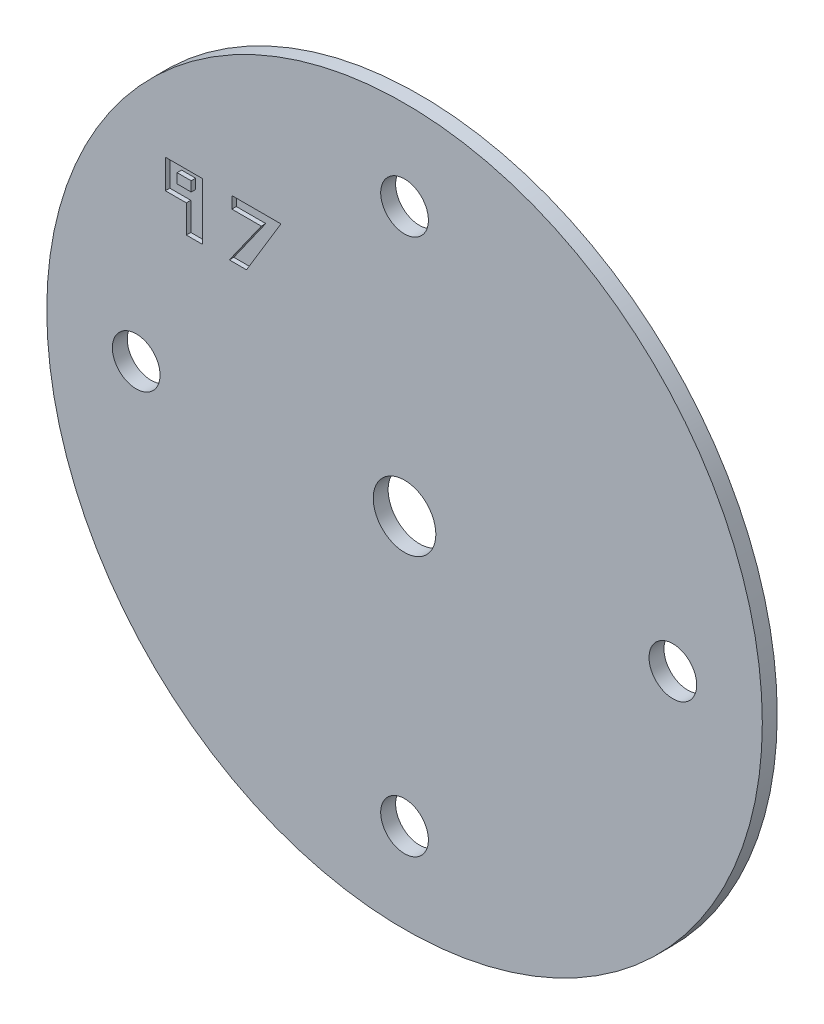
ISO-10303-21;
HEADER;
FILE_DESCRIPTION(('STEP AP214'),'2;1');
FILE_NAME('part.step','',(''),(''),'','','');
FILE_SCHEMA(('AUTOMOTIVE_DESIGN { 1 0 10303 214 1 1 1 1 }'));
ENDSEC;
DATA;
#1=APPLICATION_CONTEXT('core data for automotive mechanical design processes');
#2=APPLICATION_PROTOCOL_DEFINITION('international standard','automotive_design',2000,#1);
#3=PRODUCT_CONTEXT('',#1,'mechanical');
#4=PRODUCT('Part','Part','',(#3));
#5=PRODUCT_RELATED_PRODUCT_CATEGORY('part','',(#4));
#6=PRODUCT_DEFINITION_FORMATION('','',#4);
#7=PRODUCT_DEFINITION_CONTEXT('part definition',#1,'design');
#8=PRODUCT_DEFINITION('design','',#6,#7);
#9=PRODUCT_DEFINITION_SHAPE('','',#8);
#10=(LENGTH_UNIT() NAMED_UNIT(*) SI_UNIT(.MILLI.,.METRE.));
#11=(NAMED_UNIT(*) PLANE_ANGLE_UNIT() SI_UNIT($,.RADIAN.));
#12=(NAMED_UNIT(*) SI_UNIT($,.STERADIAN.) SOLID_ANGLE_UNIT());
#13=UNCERTAINTY_MEASURE_WITH_UNIT(LENGTH_MEASURE(1.E-05),#10,'distance_accuracy_value','');
#14=(GEOMETRIC_REPRESENTATION_CONTEXT(3) GLOBAL_UNCERTAINTY_ASSIGNED_CONTEXT((#13)) GLOBAL_UNIT_ASSIGNED_CONTEXT((#10,
#11,#12)) REPRESENTATION_CONTEXT('',''));
#15=CARTESIAN_POINT('',(0.,0.,0.));
#16=DIRECTION('',(0.,0.,1.));
#17=DIRECTION('',(1.,0.,0.));
#18=AXIS2_PLACEMENT_3D('',#15,#16,#17);
#19=CARTESIAN_POINT('',(0.,0.,1.));
#20=DIRECTION('',(0.,0.,-1.));
#21=DIRECTION('',(-1.,0.,0.));
#22=AXIS2_PLACEMENT_3D('',#19,#20,#21);
#23=CYLINDRICAL_SURFACE('',#22,24.);
#24=CARTESIAN_POINT('',(0.,0.,1.));
#25=DIRECTION('',(0.,0.,1.));
#26=DIRECTION('',(1.,0.,0.));
#27=AXIS2_PLACEMENT_3D('',#24,#25,#26);
#28=CIRCLE('',#27,24.);
#29=CARTESIAN_POINT('',(24.,0.,1.));
#30=VERTEX_POINT('',#29);
#31=EDGE_CURVE('E11',#30,#30,#28,.T.);
#32=ORIENTED_EDGE('',*,*,#31,.F.);
#33=EDGE_LOOP('',(#32));
#34=FACE_BOUND('',#33,.T.);
#35=CARTESIAN_POINT('',(0.,0.,0.));
#36=DIRECTION('',(0.,0.,1.));
#37=DIRECTION('',(1.,0.,0.));
#38=AXIS2_PLACEMENT_3D('',#35,#36,#37);
#39=CIRCLE('',#38,24.);
#40=CARTESIAN_POINT('',(24.,0.,0.));
#41=VERTEX_POINT('',#40);
#42=EDGE_CURVE('E42',#41,#41,#39,.T.);
#43=ORIENTED_EDGE('',*,*,#42,.T.);
#44=EDGE_LOOP('',(#43));
#45=FACE_BOUND('',#44,.T.);
#46=ADVANCED_FACE('F34',(#34,#45),#23,.T.);
#47=CARTESIAN_POINT('',(0.,0.,1.));
#48=DIRECTION('',(0.,0.,1.));
#49=DIRECTION('',(1.,0.,0.));
#50=AXIS2_PLACEMENT_3D('',#47,#48,#49);
#51=PLANE('',#50);
#52=DIRECTION('',(0.,-1.,0.));
#53=VECTOR('',#52,1.);
#54=CARTESIAN_POINT('',(-11.5857485501369,12.0526119938521,1.));
#55=LINE('',#54,#53);
#56=CARTESIAN_POINT('',(-11.5857485501369,12.8419465622911,1.));
#57=VERTEX_POINT('',#56);
#58=CARTESIAN_POINT('',(-11.5857485501369,12.0526119938521,1.));
#59=VERTEX_POINT('',#58);
#60=EDGE_CURVE('E50',#57,#59,#55,.T.);
#61=ORIENTED_EDGE('',*,*,#60,.F.);
#62=DIRECTION('',(-1.,0.,0.));
#63=VECTOR('',#62,1.);
#64=CARTESIAN_POINT('',(-11.5857485501369,12.8419465622911,1.));
#65=LINE('',#64,#63);
#66=CARTESIAN_POINT('',(-8.29147337255997,12.8419465622911,1.));
#67=VERTEX_POINT('',#66);
#68=EDGE_CURVE('E169',#67,#57,#65,.T.);
#69=ORIENTED_EDGE('',*,*,#68,.F.);
#70=DIRECTION('',(0.51654733057652,0.856258638072791,0.));
#71=VECTOR('',#70,1.);
#72=CARTESIAN_POINT('',(-8.29147337255997,12.8419465622911,1.));
#73=LINE('',#72,#71);
#74=CARTESIAN_POINT('',(-10.5971611908949,9.01990549406025,1.));
#75=VERTEX_POINT('',#74);
#76=EDGE_CURVE('E172',#75,#67,#73,.T.);
#77=ORIENTED_EDGE('',*,*,#76,.F.);
#78=DIRECTION('',(1.,0.,0.));
#79=VECTOR('',#78,1.);
#80=CARTESIAN_POINT('',(-10.5971611908949,9.01990549406025,1.));
#81=LINE('',#80,#79);
#82=CARTESIAN_POINT('',(-11.7519242487556,9.01990549406025,1.));
#83=VERTEX_POINT('',#82);
#84=EDGE_CURVE('E189',#83,#75,#81,.T.);
#85=ORIENTED_EDGE('',*,*,#84,.F.);
#86=DIRECTION('',(-0.577309153023354,-0.816525652894909,0.));
#87=VECTOR('',#86,1.);
#88=CARTESIAN_POINT('',(-11.7519242487556,9.01990549406025,1.));
#89=LINE('',#88,#87);
#90=CARTESIAN_POINT('',(-9.60770598132465,12.0526119938521,1.));
#91=VERTEX_POINT('',#90);
#92=EDGE_CURVE('E186',#91,#83,#89,.T.);
#93=ORIENTED_EDGE('',*,*,#92,.F.);
#94=DIRECTION('',(1.,0.,0.));
#95=VECTOR('',#94,1.);
#96=CARTESIAN_POINT('',(-9.60770598132465,12.0526119938521,1.));
#97=LINE('',#96,#95);
#98=EDGE_CURVE('E183',#59,#91,#97,.T.);
#99=ORIENTED_EDGE('',*,*,#98,.F.);
#100=EDGE_LOOP('',(#61,#69,#77,#85,#93,#99));
#101=FACE_BOUND('',#100,.T.);
#102=DIRECTION('',(0.,-1.,0.));
#103=VECTOR('',#102,1.);
#104=CARTESIAN_POINT('',(-16.0446954829768,12.8419465622911,1.));
#105=LINE('',#104,#103);
#106=CARTESIAN_POINT('',(-16.0446954829768,12.8419465622911,1.));
#107=VERTEX_POINT('',#106);
#108=CARTESIAN_POINT('',(-16.0446954829768,10.889382103521,1.));
#109=VERTEX_POINT('',#108);
#110=EDGE_CURVE('E58',#107,#109,#105,.T.);
#111=ORIENTED_EDGE('',*,*,#110,.F.);
#112=DIRECTION('',(-1.,0.,0.));
#113=VECTOR('',#112,1.);
#114=CARTESIAN_POINT('',(-13.5590849712343,12.8419465622911,1.));
#115=LINE('',#114,#113);
#116=CARTESIAN_POINT('',(-13.5590849712343,12.8419465622911,1.));
#117=VERTEX_POINT('',#116);
#118=EDGE_CURVE('E241',#117,#107,#115,.T.);
#119=ORIENTED_EDGE('',*,*,#118,.F.);
#120=DIRECTION('',(0.,1.,0.));
#121=VECTOR('',#120,1.);
#122=CARTESIAN_POINT('',(-13.5590849712343,9.01990549406025,1.));
#123=LINE('',#122,#121);
#124=CARTESIAN_POINT('',(-13.5590849712343,9.01990549406025,1.));
#125=VERTEX_POINT('',#124);
#126=EDGE_CURVE('E267',#125,#117,#123,.T.);
#127=ORIENTED_EDGE('',*,*,#126,.F.);
#128=DIRECTION('',(1.,0.,0.));
#129=VECTOR('',#128,1.);
#130=CARTESIAN_POINT('',(-14.6392270122561,9.01990549406025,1.));
#131=LINE('',#130,#129);
#132=CARTESIAN_POINT('',(-14.6392270122561,9.01990549406025,1.));
#133=VERTEX_POINT('',#132);
#134=EDGE_CURVE('E264',#133,#125,#131,.T.);
#135=ORIENTED_EDGE('',*,*,#134,.F.);
#136=DIRECTION('',(0.,-1.,0.));
#137=VECTOR('',#136,1.);
#138=CARTESIAN_POINT('',(-14.6392270122561,10.889382103521,1.));
#139=LINE('',#138,#137);
#140=CARTESIAN_POINT('',(-14.6392270122561,10.889382103521,1.));
#141=VERTEX_POINT('',#140);
#142=EDGE_CURVE('E261',#141,#133,#139,.T.);
#143=ORIENTED_EDGE('',*,*,#142,.F.);
#144=DIRECTION('',(1.,0.,0.));
#145=VECTOR('',#144,1.);
#146=CARTESIAN_POINT('',(-16.0446954829768,10.889382103521,1.));
#147=LINE('',#146,#145);
#148=EDGE_CURVE('E258',#109,#141,#147,.T.);
#149=ORIENTED_EDGE('',*,*,#148,.F.);
#150=EDGE_LOOP('',(#111,#119,#127,#135,#143,#149));
#151=FACE_BOUND('',#150,.T.);
#152=CARTESIAN_POINT('',(-18.,0.,1.));
#153=DIRECTION('',(0.,0.,1.));
#154=DIRECTION('',(1.,0.,0.));
#155=AXIS2_PLACEMENT_3D('',#152,#153,#154);
#156=CIRCLE('',#155,1.6);
#157=CARTESIAN_POINT('',(-16.4,0.,1.));
#158=VERTEX_POINT('',#157);
#159=EDGE_CURVE('E286',#158,#158,#156,.T.);
#160=ORIENTED_EDGE('',*,*,#159,.F.);
#161=EDGE_LOOP('',(#160));
#162=FACE_BOUND('',#161,.T.);
#163=CARTESIAN_POINT('',(0.,18.,1.));
#164=DIRECTION('',(0.,0.,1.));
#165=DIRECTION('',(1.,0.,0.));
#166=AXIS2_PLACEMENT_3D('',#163,#164,#165);
#167=CIRCLE('',#166,1.6);
#168=CARTESIAN_POINT('',(1.6,18.,1.));
#169=VERTEX_POINT('',#168);
#170=EDGE_CURVE('E292',#169,#169,#167,.T.);
#171=ORIENTED_EDGE('',*,*,#170,.F.);
#172=EDGE_LOOP('',(#171));
#173=FACE_BOUND('',#172,.T.);
#174=CARTESIAN_POINT('',(18.,0.,1.));
#175=DIRECTION('',(0.,0.,1.));
#176=DIRECTION('',(1.,0.,0.));
#177=AXIS2_PLACEMENT_3D('',#174,#175,#176);
#178=CIRCLE('',#177,1.6);
#179=CARTESIAN_POINT('',(19.6,0.,1.));
#180=VERTEX_POINT('',#179);
#181=EDGE_CURVE('E298',#180,#180,#178,.T.);
#182=ORIENTED_EDGE('',*,*,#181,.F.);
#183=EDGE_LOOP('',(#182));
#184=FACE_BOUND('',#183,.T.);
#185=CARTESIAN_POINT('',(0.,-18.,1.));
#186=DIRECTION('',(0.,0.,1.));
#187=DIRECTION('',(1.,0.,0.));
#188=AXIS2_PLACEMENT_3D('',#185,#186,#187);
#189=CIRCLE('',#188,1.6);
#190=CARTESIAN_POINT('',(1.6,-18.,1.));
#191=VERTEX_POINT('',#190);
#192=EDGE_CURVE('E196',#191,#191,#189,.T.);
#193=ORIENTED_EDGE('',*,*,#192,.F.);
#194=EDGE_LOOP('',(#193));
#195=FACE_BOUND('',#194,.T.);
#196=CARTESIAN_POINT('',(0.,0.,1.));
#197=DIRECTION('',(0.,0.,1.));
#198=DIRECTION('',(1.,0.,0.));
#199=AXIS2_PLACEMENT_3D('',#196,#197,#198);
#200=CIRCLE('',#199,2.1);
#201=CARTESIAN_POINT('',(2.1,0.,1.));
#202=VERTEX_POINT('',#201);
#203=EDGE_CURVE('E285',#202,#202,#200,.T.);
#204=ORIENTED_EDGE('',*,*,#203,.F.);
#205=EDGE_LOOP('',(#204));
#206=FACE_BOUND('',#205,.T.);
#207=ORIENTED_EDGE('',*,*,#31,.T.);
#208=EDGE_LOOP('',(#207));
#209=FACE_BOUND('',#208,.T.);
#210=ADVANCED_FACE('F328',(#101,#151,#162,#173,#184,#195,#206,#209),#51,.T.);
#211=CARTESIAN_POINT('',(0.,0.,0.));
#212=DIRECTION('',(0.,0.,1.));
#213=DIRECTION('',(1.,0.,0.));
#214=AXIS2_PLACEMENT_3D('',#211,#212,#213);
#215=PLANE('',#214);
#216=CARTESIAN_POINT('',(-18.,0.,0.));
#217=DIRECTION('',(0.,0.,1.));
#218=DIRECTION('',(1.,0.,0.));
#219=AXIS2_PLACEMENT_3D('',#216,#217,#218);
#220=CIRCLE('',#219,1.6);
#221=CARTESIAN_POINT('',(-16.4,0.,0.));
#222=VERTEX_POINT('',#221);
#223=EDGE_CURVE('E282',#222,#222,#220,.T.);
#224=ORIENTED_EDGE('',*,*,#223,.T.);
#225=EDGE_LOOP('',(#224));
#226=FACE_BOUND('',#225,.T.);
#227=CARTESIAN_POINT('',(0.,18.,0.));
#228=DIRECTION('',(0.,0.,1.));
#229=DIRECTION('',(1.,0.,0.));
#230=AXIS2_PLACEMENT_3D('',#227,#228,#229);
#231=CIRCLE('',#230,1.6);
#232=CARTESIAN_POINT('',(1.6,18.,0.));
#233=VERTEX_POINT('',#232);
#234=EDGE_CURVE('E289',#233,#233,#231,.T.);
#235=ORIENTED_EDGE('',*,*,#234,.T.);
#236=EDGE_LOOP('',(#235));
#237=FACE_BOUND('',#236,.T.);
#238=CARTESIAN_POINT('',(18.,0.,0.));
#239=DIRECTION('',(0.,0.,1.));
#240=DIRECTION('',(1.,0.,0.));
#241=AXIS2_PLACEMENT_3D('',#238,#239,#240);
#242=CIRCLE('',#241,1.6);
#243=CARTESIAN_POINT('',(19.6,0.,0.));
#244=VERTEX_POINT('',#243);
#245=EDGE_CURVE('E295',#244,#244,#242,.T.);
#246=ORIENTED_EDGE('',*,*,#245,.T.);
#247=EDGE_LOOP('',(#246));
#248=FACE_BOUND('',#247,.T.);
#249=CARTESIAN_POINT('',(0.,-18.,0.));
#250=DIRECTION('',(0.,0.,1.));
#251=DIRECTION('',(1.,0.,0.));
#252=AXIS2_PLACEMENT_3D('',#249,#250,#251);
#253=CIRCLE('',#252,1.6);
#254=CARTESIAN_POINT('',(1.6,-18.,0.));
#255=VERTEX_POINT('',#254);
#256=EDGE_CURVE('E301',#255,#255,#253,.T.);
#257=ORIENTED_EDGE('',*,*,#256,.T.);
#258=EDGE_LOOP('',(#257));
#259=FACE_BOUND('',#258,.T.);
#260=CARTESIAN_POINT('',(0.,0.,0.));
#261=DIRECTION('',(0.,0.,1.));
#262=DIRECTION('',(1.,0.,0.));
#263=AXIS2_PLACEMENT_3D('',#260,#261,#262);
#264=CIRCLE('',#263,2.1);
#265=CARTESIAN_POINT('',(2.1,0.,0.));
#266=VERTEX_POINT('',#265);
#267=EDGE_CURVE('E37',#266,#266,#264,.T.);
#268=ORIENTED_EDGE('',*,*,#267,.T.);
#269=EDGE_LOOP('',(#268));
#270=FACE_BOUND('',#269,.T.);
#271=ORIENTED_EDGE('',*,*,#42,.F.);
#272=EDGE_LOOP('',(#271));
#273=FACE_BOUND('',#272,.T.);
#274=ADVANCED_FACE('F313',(#226,#237,#248,#259,#270,#273),#215,.F.);
#275=CARTESIAN_POINT('',(0.,0.,-1.));
#276=DIRECTION('',(0.,0.,1.));
#277=DIRECTION('',(1.,0.,0.));
#278=AXIS2_PLACEMENT_3D('',#275,#276,#277);
#279=CYLINDRICAL_SURFACE('',#278,2.1);
#280=ORIENTED_EDGE('',*,*,#203,.T.);
#281=EDGE_LOOP('',(#280));
#282=FACE_BOUND('',#281,.T.);
#283=ORIENTED_EDGE('',*,*,#267,.F.);
#284=EDGE_LOOP('',(#283));
#285=FACE_BOUND('',#284,.T.);
#286=ADVANCED_FACE('F316',(#282,#285),#279,.F.);
#287=CARTESIAN_POINT('',(0.,-18.,0.));
#288=DIRECTION('',(0.,0.,1.));
#289=DIRECTION('',(1.,0.,0.));
#290=AXIS2_PLACEMENT_3D('',#287,#288,#289);
#291=CYLINDRICAL_SURFACE('',#290,1.6);
#292=ORIENTED_EDGE('',*,*,#256,.F.);
#293=EDGE_LOOP('',(#292));
#294=FACE_BOUND('',#293,.T.);
#295=ORIENTED_EDGE('',*,*,#192,.T.);
#296=EDGE_LOOP('',(#295));
#297=FACE_BOUND('',#296,.T.);
#298=ADVANCED_FACE('F318',(#294,#297),#291,.F.);
#299=CARTESIAN_POINT('',(18.,0.,0.));
#300=DIRECTION('',(0.,0.,1.));
#301=DIRECTION('',(1.,0.,0.));
#302=AXIS2_PLACEMENT_3D('',#299,#300,#301);
#303=CYLINDRICAL_SURFACE('',#302,1.6);
#304=ORIENTED_EDGE('',*,*,#245,.F.);
#305=EDGE_LOOP('',(#304));
#306=FACE_BOUND('',#305,.T.);
#307=ORIENTED_EDGE('',*,*,#181,.T.);
#308=EDGE_LOOP('',(#307));
#309=FACE_BOUND('',#308,.T.);
#310=ADVANCED_FACE('F325',(#306,#309),#303,.F.);
#311=CARTESIAN_POINT('',(0.,18.,0.));
#312=DIRECTION('',(0.,0.,1.));
#313=DIRECTION('',(1.,0.,0.));
#314=AXIS2_PLACEMENT_3D('',#311,#312,#313);
#315=CYLINDRICAL_SURFACE('',#314,1.6);
#316=ORIENTED_EDGE('',*,*,#234,.F.);
#317=EDGE_LOOP('',(#316));
#318=FACE_BOUND('',#317,.T.);
#319=ORIENTED_EDGE('',*,*,#170,.T.);
#320=EDGE_LOOP('',(#319));
#321=FACE_BOUND('',#320,.T.);
#322=ADVANCED_FACE('F404',(#318,#321),#315,.F.);
#323=CARTESIAN_POINT('',(-18.,0.,0.));
#324=DIRECTION('',(0.,0.,1.));
#325=DIRECTION('',(1.,0.,0.));
#326=AXIS2_PLACEMENT_3D('',#323,#324,#325);
#327=CYLINDRICAL_SURFACE('',#326,1.6);
#328=ORIENTED_EDGE('',*,*,#223,.F.);
#329=EDGE_LOOP('',(#328));
#330=FACE_BOUND('',#329,.T.);
#331=ORIENTED_EDGE('',*,*,#159,.T.);
#332=EDGE_LOOP('',(#331));
#333=FACE_BOUND('',#332,.T.);
#334=ADVANCED_FACE('F410',(#330,#333),#327,.F.);
#335=CARTESIAN_POINT('',(-16.0446954829768,12.8419465622911,0.7));
#336=DIRECTION('',(-1.,0.,0.));
#337=DIRECTION('',(0.,0.,1.));
#338=AXIS2_PLACEMENT_3D('',#335,#336,#337);
#339=PLANE('',#338);
#340=ORIENTED_EDGE('',*,*,#110,.T.);
#341=DIRECTION('',(0.,0.,1.));
#342=VECTOR('',#341,1.);
#343=CARTESIAN_POINT('',(-16.0446954829768,10.889382103521,0.7));
#344=LINE('',#343,#342);
#345=CARTESIAN_POINT('',(-16.0446954829768,10.889382103521,0.7));
#346=VERTEX_POINT('',#345);
#347=EDGE_CURVE('E256',#346,#109,#344,.T.);
#348=ORIENTED_EDGE('',*,*,#347,.F.);
#349=DIRECTION('',(0.,-1.,0.));
#350=VECTOR('',#349,1.);
#351=CARTESIAN_POINT('',(-16.0446954829768,12.8419465622911,0.7));
#352=LINE('',#351,#350);
#353=CARTESIAN_POINT('',(-16.0446954829768,12.8419465622911,0.7));
#354=VERTEX_POINT('',#353);
#355=EDGE_CURVE('E237',#354,#346,#352,.T.);
#356=ORIENTED_EDGE('',*,*,#355,.F.);
#357=DIRECTION('',(0.,0.,1.));
#358=VECTOR('',#357,1.);
#359=CARTESIAN_POINT('',(-16.0446954829768,12.8419465622911,0.7));
#360=LINE('',#359,#358);
#361=EDGE_CURVE('E184',#354,#107,#360,.T.);
#362=ORIENTED_EDGE('',*,*,#361,.T.);
#363=EDGE_LOOP('',(#340,#348,#356,#362));
#364=FACE_BOUND('',#363,.T.);
#365=ADVANCED_FACE('F373',(#364),#339,.F.);
#366=CARTESIAN_POINT('',(-13.5590849712343,12.8419465622911,0.7));
#367=DIRECTION('',(0.,1.,0.));
#368=DIRECTION('',(0.,0.,1.));
#369=AXIS2_PLACEMENT_3D('',#366,#367,#368);
#370=PLANE('',#369);
#371=ORIENTED_EDGE('',*,*,#118,.T.);
#372=ORIENTED_EDGE('',*,*,#361,.F.);
#373=DIRECTION('',(-1.,0.,0.));
#374=VECTOR('',#373,1.);
#375=CARTESIAN_POINT('',(-13.5590849712343,12.8419465622911,0.7));
#376=LINE('',#375,#374);
#377=CARTESIAN_POINT('',(-13.5590849712343,12.8419465622911,0.7));
#378=VERTEX_POINT('',#377);
#379=EDGE_CURVE('E253',#378,#354,#376,.T.);
#380=ORIENTED_EDGE('',*,*,#379,.F.);
#381=DIRECTION('',(0.,0.,1.));
#382=VECTOR('',#381,1.);
#383=CARTESIAN_POINT('',(-13.5590849712343,12.8419465622911,0.7));
#384=LINE('',#383,#382);
#385=EDGE_CURVE('E273',#378,#117,#384,.T.);
#386=ORIENTED_EDGE('',*,*,#385,.T.);
#387=EDGE_LOOP('',(#371,#372,#380,#386));
#388=FACE_BOUND('',#387,.T.);
#389=ADVANCED_FACE('F390',(#388),#370,.F.);
#390=CARTESIAN_POINT('',(-13.5590849712343,9.01990549406025,0.7));
#391=DIRECTION('',(1.,0.,0.));
#392=DIRECTION('',(0.,0.,-1.));
#393=AXIS2_PLACEMENT_3D('',#390,#391,#392);
#394=PLANE('',#393);
#395=ORIENTED_EDGE('',*,*,#126,.T.);
#396=ORIENTED_EDGE('',*,*,#385,.F.);
#397=DIRECTION('',(0.,1.,0.));
#398=VECTOR('',#397,1.);
#399=CARTESIAN_POINT('',(-13.5590849712343,9.01990549406025,0.7));
#400=LINE('',#399,#398);
#401=CARTESIAN_POINT('',(-13.5590849712343,9.01990549406025,0.7));
#402=VERTEX_POINT('',#401);
#403=EDGE_CURVE('E250',#402,#378,#400,.T.);
#404=ORIENTED_EDGE('',*,*,#403,.F.);
#405=DIRECTION('',(0.,0.,1.));
#406=VECTOR('',#405,1.);
#407=CARTESIAN_POINT('',(-13.5590849712343,9.01990549406025,0.7));
#408=LINE('',#407,#406);
#409=EDGE_CURVE('E275',#402,#125,#408,.T.);
#410=ORIENTED_EDGE('',*,*,#409,.T.);
#411=EDGE_LOOP('',(#395,#396,#404,#410));
#412=FACE_BOUND('',#411,.T.);
#413=ADVANCED_FACE('F387',(#412),#394,.F.);
#414=CARTESIAN_POINT('',(-14.6392270122561,9.01990549406025,0.7));
#415=DIRECTION('',(0.,-1.,0.));
#416=DIRECTION('',(0.,0.,-1.));
#417=AXIS2_PLACEMENT_3D('',#414,#415,#416);
#418=PLANE('',#417);
#419=ORIENTED_EDGE('',*,*,#134,.T.);
#420=ORIENTED_EDGE('',*,*,#409,.F.);
#421=DIRECTION('',(1.,0.,0.));
#422=VECTOR('',#421,1.);
#423=CARTESIAN_POINT('',(-14.6392270122561,9.01990549406025,0.7));
#424=LINE('',#423,#422);
#425=CARTESIAN_POINT('',(-14.6392270122561,9.01990549406025,0.7));
#426=VERTEX_POINT('',#425);
#427=EDGE_CURVE('E247',#426,#402,#424,.T.);
#428=ORIENTED_EDGE('',*,*,#427,.F.);
#429=DIRECTION('',(0.,0.,1.));
#430=VECTOR('',#429,1.);
#431=CARTESIAN_POINT('',(-14.6392270122561,9.01990549406025,0.7));
#432=LINE('',#431,#430);
#433=EDGE_CURVE('E277',#426,#133,#432,.T.);
#434=ORIENTED_EDGE('',*,*,#433,.T.);
#435=EDGE_LOOP('',(#419,#420,#428,#434));
#436=FACE_BOUND('',#435,.T.);
#437=ADVANCED_FACE('F383',(#436),#418,.F.);
#438=CARTESIAN_POINT('',(-14.6392270122561,10.889382103521,0.7));
#439=DIRECTION('',(-1.,0.,0.));
#440=DIRECTION('',(0.,0.,1.));
#441=AXIS2_PLACEMENT_3D('',#438,#439,#440);
#442=PLANE('',#441);
#443=ORIENTED_EDGE('',*,*,#142,.T.);
#444=ORIENTED_EDGE('',*,*,#433,.F.);
#445=DIRECTION('',(0.,-1.,0.));
#446=VECTOR('',#445,1.);
#447=CARTESIAN_POINT('',(-14.6392270122561,10.889382103521,0.7));
#448=LINE('',#447,#446);
#449=CARTESIAN_POINT('',(-14.6392270122561,10.889382103521,0.7));
#450=VERTEX_POINT('',#449);
#451=EDGE_CURVE('E244',#450,#426,#448,.T.);
#452=ORIENTED_EDGE('',*,*,#451,.F.);
#453=DIRECTION('',(0.,0.,1.));
#454=VECTOR('',#453,1.);
#455=CARTESIAN_POINT('',(-14.6392270122561,10.889382103521,0.7));
#456=LINE('',#455,#454);
#457=EDGE_CURVE('E279',#450,#141,#456,.T.);
#458=ORIENTED_EDGE('',*,*,#457,.T.);
#459=EDGE_LOOP('',(#443,#444,#452,#458));
#460=FACE_BOUND('',#459,.T.);
#461=ADVANCED_FACE('F379',(#460),#442,.F.);
#462=CARTESIAN_POINT('',(-16.0446954829768,10.889382103521,0.7));
#463=DIRECTION('',(0.,-1.,0.));
#464=DIRECTION('',(0.,0.,-1.));
#465=AXIS2_PLACEMENT_3D('',#462,#463,#464);
#466=PLANE('',#465);
#467=ORIENTED_EDGE('',*,*,#148,.T.);
#468=ORIENTED_EDGE('',*,*,#457,.F.);
#469=DIRECTION('',(1.,0.,0.));
#470=VECTOR('',#469,1.);
#471=CARTESIAN_POINT('',(-16.0446954829768,10.889382103521,0.7));
#472=LINE('',#471,#470);
#473=EDGE_CURVE('E240',#346,#450,#472,.T.);
#474=ORIENTED_EDGE('',*,*,#473,.F.);
#475=ORIENTED_EDGE('',*,*,#347,.T.);
#476=EDGE_LOOP('',(#467,#468,#474,#475));
#477=FACE_BOUND('',#476,.T.);
#478=ADVANCED_FACE('F368',(#477),#466,.F.);
#479=CARTESIAN_POINT('',(0.,0.,0.7));
#480=DIRECTION('',(0.,0.,1.));
#481=DIRECTION('',(1.,0.,0.));
#482=AXIS2_PLACEMENT_3D('',#479,#480,#481);
#483=PLANE('',#482);
#484=DIRECTION('',(-1.,0.,0.));
#485=VECTOR('',#484,1.);
#486=CARTESIAN_POINT('',(-15.2549951943157,12.3361232440519,0.7));
#487=LINE('',#486,#485);
#488=CARTESIAN_POINT('',(-14.3112070444524,12.3361232440519,0.7));
#489=VERTEX_POINT('',#488);
#490=CARTESIAN_POINT('',(-15.2549951943157,12.3361232440519,0.7));
#491=VERTEX_POINT('',#490);
#492=EDGE_CURVE('E214',#489,#491,#487,.T.);
#493=ORIENTED_EDGE('',*,*,#492,.F.);
#494=DIRECTION('',(0.,1.,0.));
#495=VECTOR('',#494,1.);
#496=CARTESIAN_POINT('',(-14.3112070444524,12.3361232440519,0.7));
#497=LINE('',#496,#495);
#498=CARTESIAN_POINT('',(-14.3112070444524,11.6812498339427,0.7));
#499=VERTEX_POINT('',#498);
#500=EDGE_CURVE('E211',#499,#489,#497,.T.);
#501=ORIENTED_EDGE('',*,*,#500,.F.);
#502=DIRECTION('',(1.,0.,0.));
#503=VECTOR('',#502,1.);
#504=CARTESIAN_POINT('',(-14.3112070444524,11.6812498339427,0.7));
#505=LINE('',#504,#503);
#506=CARTESIAN_POINT('',(-15.2549951943157,11.6812498339427,0.7));
#507=VERTEX_POINT('',#506);
#508=EDGE_CURVE('E207',#507,#499,#505,.T.);
#509=ORIENTED_EDGE('',*,*,#508,.F.);
#510=DIRECTION('',(0.,-1.,0.));
#511=VECTOR('',#510,1.);
#512=CARTESIAN_POINT('',(-15.2549951943157,11.6812498339427,0.7));
#513=LINE('',#512,#511);
#514=EDGE_CURVE('E204',#491,#507,#513,.T.);
#515=ORIENTED_EDGE('',*,*,#514,.F.);
#516=EDGE_LOOP('',(#493,#501,#509,#515));
#517=FACE_BOUND('',#516,.T.);
#518=ORIENTED_EDGE('',*,*,#355,.T.);
#519=ORIENTED_EDGE('',*,*,#473,.T.);
#520=ORIENTED_EDGE('',*,*,#451,.T.);
#521=ORIENTED_EDGE('',*,*,#427,.T.);
#522=ORIENTED_EDGE('',*,*,#403,.T.);
#523=ORIENTED_EDGE('',*,*,#379,.T.);
#524=EDGE_LOOP('',(#518,#519,#520,#521,#522,#523));
#525=FACE_BOUND('',#524,.T.);
#526=ADVANCED_FACE('F365',(#517,#525),#483,.T.);
#527=CARTESIAN_POINT('',(-15.2549951943157,11.6812498339427,0.7));
#528=DIRECTION('',(-1.,0.,0.));
#529=DIRECTION('',(0.,0.,1.));
#530=AXIS2_PLACEMENT_3D('',#527,#528,#529);
#531=PLANE('',#530);
#532=DIRECTION('',(0.,-1.,0.));
#533=VECTOR('',#532,1.);
#534=CARTESIAN_POINT('',(-15.2549951943157,11.6812498339427,1.));
#535=LINE('',#534,#533);
#536=CARTESIAN_POINT('',(-15.2549951943157,12.3361232440519,1.));
#537=VERTEX_POINT('',#536);
#538=CARTESIAN_POINT('',(-15.2549951943157,11.6812498339427,1.));
#539=VERTEX_POINT('',#538);
#540=EDGE_CURVE('E218',#537,#539,#535,.T.);
#541=ORIENTED_EDGE('',*,*,#540,.F.);
#542=DIRECTION('',(0.,0.,1.));
#543=VECTOR('',#542,1.);
#544=CARTESIAN_POINT('',(-15.2549951943157,12.3361232440519,0.7));
#545=LINE('',#544,#543);
#546=EDGE_CURVE('E229',#491,#537,#545,.T.);
#547=ORIENTED_EDGE('',*,*,#546,.F.);
#548=ORIENTED_EDGE('',*,*,#514,.T.);
#549=DIRECTION('',(0.,0.,1.));
#550=VECTOR('',#549,1.);
#551=CARTESIAN_POINT('',(-15.2549951943157,11.6812498339427,0.7));
#552=LINE('',#551,#550);
#553=EDGE_CURVE('E217',#507,#539,#552,.T.);
#554=ORIENTED_EDGE('',*,*,#553,.T.);
#555=EDGE_LOOP('',(#541,#547,#548,#554));
#556=FACE_BOUND('',#555,.T.);
#557=ADVANCED_FACE('F356',(#556),#531,.T.);
#558=CARTESIAN_POINT('',(-15.2549951943157,12.3361232440519,0.7));
#559=DIRECTION('',(0.,1.,0.));
#560=DIRECTION('',(0.,0.,1.));
#561=AXIS2_PLACEMENT_3D('',#558,#559,#560);
#562=PLANE('',#561);
#563=DIRECTION('',(-1.,0.,0.));
#564=VECTOR('',#563,1.);
#565=CARTESIAN_POINT('',(-15.2549951943157,12.3361232440519,1.));
#566=LINE('',#565,#564);
#567=CARTESIAN_POINT('',(-14.3112070444524,12.3361232440519,1.));
#568=VERTEX_POINT('',#567);
#569=EDGE_CURVE('E208',#568,#537,#566,.T.);
#570=ORIENTED_EDGE('',*,*,#569,.F.);
#571=DIRECTION('',(0.,0.,1.));
#572=VECTOR('',#571,1.);
#573=CARTESIAN_POINT('',(-14.3112070444524,12.3361232440519,0.7));
#574=LINE('',#573,#572);
#575=EDGE_CURVE('E231',#489,#568,#574,.T.);
#576=ORIENTED_EDGE('',*,*,#575,.F.);
#577=ORIENTED_EDGE('',*,*,#492,.T.);
#578=ORIENTED_EDGE('',*,*,#546,.T.);
#579=EDGE_LOOP('',(#570,#576,#577,#578));
#580=FACE_BOUND('',#579,.T.);
#581=ADVANCED_FACE('F352',(#580),#562,.T.);
#582=CARTESIAN_POINT('',(-14.3112070444524,12.3361232440519,0.7));
#583=DIRECTION('',(1.,0.,0.));
#584=DIRECTION('',(0.,0.,-1.));
#585=AXIS2_PLACEMENT_3D('',#582,#583,#584);
#586=PLANE('',#585);
#587=DIRECTION('',(0.,1.,0.));
#588=VECTOR('',#587,1.);
#589=CARTESIAN_POINT('',(-14.3112070444524,12.3361232440519,1.));
#590=LINE('',#589,#588);
#591=CARTESIAN_POINT('',(-14.3112070444524,11.6812498339427,1.));
#592=VERTEX_POINT('',#591);
#593=EDGE_CURVE('E224',#592,#568,#590,.T.);
#594=ORIENTED_EDGE('',*,*,#593,.F.);
#595=DIRECTION('',(0.,0.,1.));
#596=VECTOR('',#595,1.);
#597=CARTESIAN_POINT('',(-14.3112070444524,11.6812498339427,0.7));
#598=LINE('',#597,#596);
#599=EDGE_CURVE('E233',#499,#592,#598,.T.);
#600=ORIENTED_EDGE('',*,*,#599,.F.);
#601=ORIENTED_EDGE('',*,*,#500,.T.);
#602=ORIENTED_EDGE('',*,*,#575,.T.);
#603=EDGE_LOOP('',(#594,#600,#601,#602));
#604=FACE_BOUND('',#603,.T.);
#605=ADVANCED_FACE('F363',(#604),#586,.T.);
#606=CARTESIAN_POINT('',(-14.3112070444524,11.6812498339427,0.7));
#607=DIRECTION('',(0.,-1.,0.));
#608=DIRECTION('',(0.,0.,-1.));
#609=AXIS2_PLACEMENT_3D('',#606,#607,#608);
#610=PLANE('',#609);
#611=DIRECTION('',(1.,0.,0.));
#612=VECTOR('',#611,1.);
#613=CARTESIAN_POINT('',(-14.3112070444524,11.6812498339427,1.));
#614=LINE('',#613,#612);
#615=EDGE_CURVE('E221',#539,#592,#614,.T.);
#616=ORIENTED_EDGE('',*,*,#615,.F.);
#617=ORIENTED_EDGE('',*,*,#553,.F.);
#618=ORIENTED_EDGE('',*,*,#508,.T.);
#619=ORIENTED_EDGE('',*,*,#599,.T.);
#620=EDGE_LOOP('',(#616,#617,#618,#619));
#621=FACE_BOUND('',#620,.T.);
#622=ADVANCED_FACE('F360',(#621),#610,.T.);
#623=CARTESIAN_POINT('',(-11.5857485501369,12.0526119938521,0.7));
#624=DIRECTION('',(-1.,0.,0.));
#625=DIRECTION('',(0.,0.,1.));
#626=AXIS2_PLACEMENT_3D('',#623,#624,#625);
#627=PLANE('',#626);
#628=ORIENTED_EDGE('',*,*,#60,.T.);
#629=DIRECTION('',(0.,0.,1.));
#630=VECTOR('',#629,1.);
#631=CARTESIAN_POINT('',(-11.5857485501369,12.0526119938521,0.7));
#632=LINE('',#631,#630);
#633=CARTESIAN_POINT('',(-11.5857485501369,12.0526119938521,0.7));
#634=VERTEX_POINT('',#633);
#635=EDGE_CURVE('E146',#634,#59,#632,.T.);
#636=ORIENTED_EDGE('',*,*,#635,.F.);
#637=DIRECTION('',(0.,-1.,0.));
#638=VECTOR('',#637,1.);
#639=CARTESIAN_POINT('',(-11.5857485501369,12.0526119938521,0.7));
#640=LINE('',#639,#638);
#641=CARTESIAN_POINT('',(-11.5857485501369,12.8419465622911,0.7));
#642=VERTEX_POINT('',#641);
#643=EDGE_CURVE('E150',#642,#634,#640,.T.);
#644=ORIENTED_EDGE('',*,*,#643,.F.);
#645=DIRECTION('',(0.,0.,1.));
#646=VECTOR('',#645,1.);
#647=CARTESIAN_POINT('',(-11.5857485501369,12.8419465622911,0.7));
#648=LINE('',#647,#646);
#649=EDGE_CURVE('E194',#642,#57,#648,.T.);
#650=ORIENTED_EDGE('',*,*,#649,.T.);
#651=EDGE_LOOP('',(#628,#636,#644,#650));
#652=FACE_BOUND('',#651,.T.);
#653=ADVANCED_FACE('F148',(#652),#627,.F.);
#654=CARTESIAN_POINT('',(-11.5857485501369,12.8419465622911,0.7));
#655=DIRECTION('',(0.,1.,0.));
#656=DIRECTION('',(0.,0.,1.));
#657=AXIS2_PLACEMENT_3D('',#654,#655,#656);
#658=PLANE('',#657);
#659=ORIENTED_EDGE('',*,*,#68,.T.);
#660=ORIENTED_EDGE('',*,*,#649,.F.);
#661=DIRECTION('',(-1.,0.,0.));
#662=VECTOR('',#661,1.);
#663=CARTESIAN_POINT('',(-11.5857485501369,12.8419465622911,0.7));
#664=LINE('',#663,#662);
#665=CARTESIAN_POINT('',(-8.29147337255997,12.8419465622911,0.7));
#666=VERTEX_POINT('',#665);
#667=EDGE_CURVE('E156',#666,#642,#664,.T.);
#668=ORIENTED_EDGE('',*,*,#667,.F.);
#669=DIRECTION('',(0.,0.,1.));
#670=VECTOR('',#669,1.);
#671=CARTESIAN_POINT('',(-8.29147337255997,12.8419465622911,0.7));
#672=LINE('',#671,#670);
#673=EDGE_CURVE('E197',#666,#67,#672,.T.);
#674=ORIENTED_EDGE('',*,*,#673,.T.);
#675=EDGE_LOOP('',(#659,#660,#668,#674));
#676=FACE_BOUND('',#675,.T.);
#677=ADVANCED_FACE('F440',(#676),#658,.F.);
#678=CARTESIAN_POINT('',(-8.29147337255997,12.8419465622911,0.7));
#679=DIRECTION('',(0.856258638072791,-0.51654733057652,0.));
#680=DIRECTION('',(0.51654733057652,0.856258638072791,0.));
#681=AXIS2_PLACEMENT_3D('',#678,#679,#680);
#682=PLANE('',#681);
#683=ORIENTED_EDGE('',*,*,#76,.T.);
#684=ORIENTED_EDGE('',*,*,#673,.F.);
#685=DIRECTION('',(0.51654733057652,0.856258638072791,0.));
#686=VECTOR('',#685,1.);
#687=CARTESIAN_POINT('',(-8.29147337255997,12.8419465622911,0.7));
#688=LINE('',#687,#686);
#689=CARTESIAN_POINT('',(-10.5971611908949,9.01990549406025,0.7));
#690=VERTEX_POINT('',#689);
#691=EDGE_CURVE('E179',#690,#666,#688,.T.);
#692=ORIENTED_EDGE('',*,*,#691,.F.);
#693=DIRECTION('',(0.,0.,1.));
#694=VECTOR('',#693,1.);
#695=CARTESIAN_POINT('',(-10.5971611908949,9.01990549406025,0.7));
#696=LINE('',#695,#694);
#697=EDGE_CURVE('E199',#690,#75,#696,.T.);
#698=ORIENTED_EDGE('',*,*,#697,.T.);
#699=EDGE_LOOP('',(#683,#684,#692,#698));
#700=FACE_BOUND('',#699,.T.);
#701=ADVANCED_FACE('F450',(#700),#682,.F.);
#702=CARTESIAN_POINT('',(-10.5971611908949,9.01990549406025,0.7));
#703=DIRECTION('',(0.,-1.,0.));
#704=DIRECTION('',(0.,0.,-1.));
#705=AXIS2_PLACEMENT_3D('',#702,#703,#704);
#706=PLANE('',#705);
#707=ORIENTED_EDGE('',*,*,#84,.T.);
#708=ORIENTED_EDGE('',*,*,#697,.F.);
#709=DIRECTION('',(1.,0.,0.));
#710=VECTOR('',#709,1.);
#711=CARTESIAN_POINT('',(-10.5971611908949,9.01990549406025,0.7));
#712=LINE('',#711,#710);
#713=CARTESIAN_POINT('',(-11.7519242487556,9.01990549406025,0.7));
#714=VERTEX_POINT('',#713);
#715=EDGE_CURVE('E176',#714,#690,#712,.T.);
#716=ORIENTED_EDGE('',*,*,#715,.F.);
#717=DIRECTION('',(0.,0.,1.));
#718=VECTOR('',#717,1.);
#719=CARTESIAN_POINT('',(-11.7519242487556,9.01990549406025,0.7));
#720=LINE('',#719,#718);
#721=EDGE_CURVE('E201',#714,#83,#720,.T.);
#722=ORIENTED_EDGE('',*,*,#721,.T.);
#723=EDGE_LOOP('',(#707,#708,#716,#722));
#724=FACE_BOUND('',#723,.T.);
#725=ADVANCED_FACE('F446',(#724),#706,.F.);
#726=CARTESIAN_POINT('',(-11.7519242487556,9.01990549406025,0.7));
#727=DIRECTION('',(-0.816525652894909,0.577309153023354,0.));
#728=DIRECTION('',(-0.577309153023354,-0.816525652894909,0.));
#729=AXIS2_PLACEMENT_3D('',#726,#727,#728);
#730=PLANE('',#729);
#731=ORIENTED_EDGE('',*,*,#92,.T.);
#732=ORIENTED_EDGE('',*,*,#721,.F.);
#733=DIRECTION('',(-0.577309153023354,-0.816525652894909,0.));
#734=VECTOR('',#733,1.);
#735=CARTESIAN_POINT('',(-11.7519242487556,9.01990549406025,0.7));
#736=LINE('',#735,#734);
#737=CARTESIAN_POINT('',(-9.60770598132465,12.0526119938521,0.7));
#738=VERTEX_POINT('',#737);
#739=EDGE_CURVE('E164',#738,#714,#736,.T.);
#740=ORIENTED_EDGE('',*,*,#739,.F.);
#741=DIRECTION('',(0.,0.,1.));
#742=VECTOR('',#741,1.);
#743=CARTESIAN_POINT('',(-9.60770598132465,12.0526119938521,0.7));
#744=LINE('',#743,#742);
#745=EDGE_CURVE('E155',#738,#91,#744,.T.);
#746=ORIENTED_EDGE('',*,*,#745,.T.);
#747=EDGE_LOOP('',(#731,#732,#740,#746));
#748=FACE_BOUND('',#747,.T.);
#749=ADVANCED_FACE('F443',(#748),#730,.F.);
#750=CARTESIAN_POINT('',(-9.60770598132465,12.0526119938521,0.7));
#751=DIRECTION('',(0.,-1.,0.));
#752=DIRECTION('',(0.,0.,-1.));
#753=AXIS2_PLACEMENT_3D('',#750,#751,#752);
#754=PLANE('',#753);
#755=ORIENTED_EDGE('',*,*,#98,.T.);
#756=ORIENTED_EDGE('',*,*,#745,.F.);
#757=DIRECTION('',(1.,0.,0.));
#758=VECTOR('',#757,1.);
#759=CARTESIAN_POINT('',(-9.60770598132465,12.0526119938521,0.7));
#760=LINE('',#759,#758);
#761=EDGE_CURVE('E159',#634,#738,#760,.T.);
#762=ORIENTED_EDGE('',*,*,#761,.F.);
#763=ORIENTED_EDGE('',*,*,#635,.T.);
#764=EDGE_LOOP('',(#755,#756,#762,#763));
#765=FACE_BOUND('',#764,.T.);
#766=ADVANCED_FACE('F160',(#765),#754,.F.);
#767=CARTESIAN_POINT('',(0.,0.,0.7));
#768=DIRECTION('',(0.,0.,-1.));
#769=DIRECTION('',(-1.,0.,0.));
#770=AXIS2_PLACEMENT_3D('',#767,#768,#769);
#771=PLANE('',#770);
#772=ORIENTED_EDGE('',*,*,#643,.T.);
#773=ORIENTED_EDGE('',*,*,#761,.T.);
#774=ORIENTED_EDGE('',*,*,#739,.T.);
#775=ORIENTED_EDGE('',*,*,#715,.T.);
#776=ORIENTED_EDGE('',*,*,#691,.T.);
#777=ORIENTED_EDGE('',*,*,#667,.T.);
#778=EDGE_LOOP('',(#772,#773,#774,#775,#776,#777));
#779=FACE_BOUND('',#778,.T.);
#780=ADVANCED_FACE('F166',(#779),#771,.F.);
#781=ORIENTED_EDGE('',*,*,#569,.T.);
#782=ORIENTED_EDGE('',*,*,#540,.T.);
#783=ORIENTED_EDGE('',*,*,#615,.T.);
#784=ORIENTED_EDGE('',*,*,#593,.T.);
#785=EDGE_LOOP('',(#781,#782,#783,#784));
#786=FACE_BOUND('',#785,.T.);
#787=ADVANCED_FACE('F337',(#786),#51,.T.);
#788=CLOSED_SHELL('',(#46,#210,#274,#286,#298,#310,#322,#334,#365,#389,#413,#437,#461,#478,#526,
#557,#581,#605,#622,#653,#677,#701,#725,#749,#766,#780,#787));
#789=MANIFOLD_SOLID_BREP('B2',#788);
#790=ADVANCED_BREP_SHAPE_REPRESENTATION('',(#18,#789),#14);
#791=SHAPE_DEFINITION_REPRESENTATION(#9,#790);
ENDSEC;
END-ISO-10303-21;
